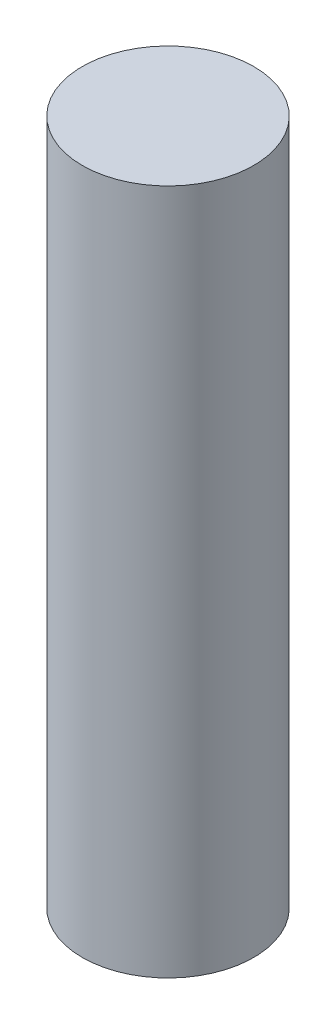
ISO-10303-21;
HEADER;
FILE_DESCRIPTION(('STEP AP214'),'2;1');
FILE_NAME('part.step','',(''),(''),'','','');
FILE_SCHEMA(('AUTOMOTIVE_DESIGN { 1 0 10303 214 1 1 1 1 }'));
ENDSEC;
DATA;
#1=APPLICATION_CONTEXT('core data for automotive mechanical design processes');
#2=APPLICATION_PROTOCOL_DEFINITION('international standard','automotive_design',2000,#1);
#3=PRODUCT_CONTEXT('',#1,'mechanical');
#4=PRODUCT('Part','Part','',(#3));
#5=PRODUCT_RELATED_PRODUCT_CATEGORY('part','',(#4));
#6=PRODUCT_DEFINITION_FORMATION('','',#4);
#7=PRODUCT_DEFINITION_CONTEXT('part definition',#1,'design');
#8=PRODUCT_DEFINITION('design','',#6,#7);
#9=PRODUCT_DEFINITION_SHAPE('','',#8);
#10=(LENGTH_UNIT() NAMED_UNIT(*) SI_UNIT(.MILLI.,.METRE.));
#11=(NAMED_UNIT(*) PLANE_ANGLE_UNIT() SI_UNIT($,.RADIAN.));
#12=(NAMED_UNIT(*) SI_UNIT($,.STERADIAN.) SOLID_ANGLE_UNIT());
#13=UNCERTAINTY_MEASURE_WITH_UNIT(LENGTH_MEASURE(1.E-05),#10,'distance_accuracy_value','');
#14=(GEOMETRIC_REPRESENTATION_CONTEXT(3) GLOBAL_UNCERTAINTY_ASSIGNED_CONTEXT((#13)) GLOBAL_UNIT_ASSIGNED_CONTEXT((#10,
#11,#12)) REPRESENTATION_CONTEXT('',''));
#15=CARTESIAN_POINT('',(0.,0.,0.));
#16=DIRECTION('',(0.,0.,1.));
#17=DIRECTION('',(1.,0.,0.));
#18=AXIS2_PLACEMENT_3D('',#15,#16,#17);
#19=CARTESIAN_POINT('',(-1.5,12.,0.));
#20=DIRECTION('',(0.,-1.,0.));
#21=DIRECTION('',(0.,0.,-1.));
#22=AXIS2_PLACEMENT_3D('',#19,#20,#21);
#23=PLANE('',#22);
#24=CARTESIAN_POINT('',(0.,12.,0.));
#25=DIRECTION('',(0.,-1.,0.));
#26=DIRECTION('',(0.,0.,-1.));
#27=AXIS2_PLACEMENT_3D('',#24,#25,#26);
#28=CIRCLE('',#27,1.5);
#29=CARTESIAN_POINT('',(0.,12.,-1.5));
#30=VERTEX_POINT('',#29);
#31=EDGE_CURVE('E10',#30,#30,#28,.T.);
#32=ORIENTED_EDGE('',*,*,#31,.F.);
#33=EDGE_LOOP('',(#32));
#34=FACE_BOUND('',#33,.T.);
#35=ADVANCED_FACE('F37',(#34),#23,.F.);
#36=CARTESIAN_POINT('',(0.,0.,0.));
#37=DIRECTION('',(0.,-1.,0.));
#38=DIRECTION('',(0.,0.,-1.));
#39=AXIS2_PLACEMENT_3D('',#36,#37,#38);
#40=CYLINDRICAL_SURFACE('',#39,1.5);
#41=CARTESIAN_POINT('',(0.,0.,0.));
#42=DIRECTION('',(0.,-1.,0.));
#43=DIRECTION('',(0.,0.,-1.));
#44=AXIS2_PLACEMENT_3D('',#41,#42,#43);
#45=CIRCLE('',#44,1.5);
#46=CARTESIAN_POINT('',(0.,0.,-1.5));
#47=VERTEX_POINT('',#46);
#48=EDGE_CURVE('E44',#47,#47,#45,.T.);
#49=ORIENTED_EDGE('',*,*,#48,.F.);
#50=EDGE_LOOP('',(#49));
#51=FACE_BOUND('',#50,.T.);
#52=ORIENTED_EDGE('',*,*,#31,.T.);
#53=EDGE_LOOP('',(#52));
#54=FACE_BOUND('',#53,.T.);
#55=ADVANCED_FACE('F53',(#51,#54),#40,.T.);
#56=CARTESIAN_POINT('',(-1.5,0.,0.));
#57=DIRECTION('',(0.,1.,0.));
#58=DIRECTION('',(0.,0.,1.));
#59=AXIS2_PLACEMENT_3D('',#56,#57,#58);
#60=PLANE('',#59);
#61=ORIENTED_EDGE('',*,*,#48,.T.);
#62=EDGE_LOOP('',(#61));
#63=FACE_BOUND('',#62,.T.);
#64=ADVANCED_FACE('F51',(#63),#60,.F.);
#65=CLOSED_SHELL('',(#35,#55,#64));
#66=MANIFOLD_SOLID_BREP('B2',#65);
#67=ADVANCED_BREP_SHAPE_REPRESENTATION('',(#18,#66),#14);
#68=SHAPE_DEFINITION_REPRESENTATION(#9,#67);
ENDSEC;
END-ISO-10303-21;
